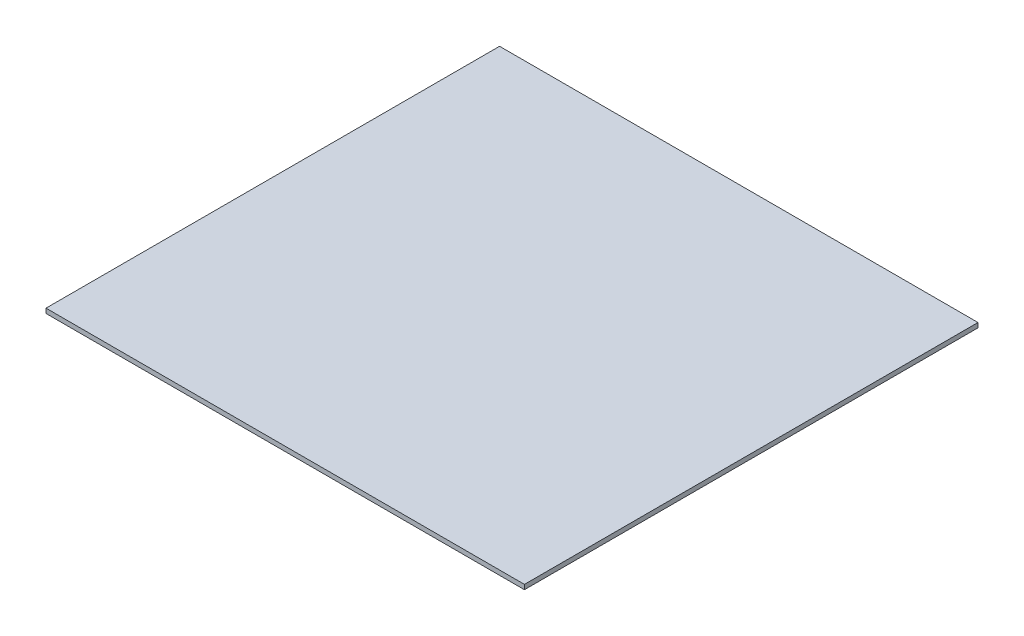
ISO-10303-21;
HEADER;
FILE_DESCRIPTION(('STEP AP214'),'2;1');
FILE_NAME('part.step','',(''),(''),'','','');
FILE_SCHEMA(('AUTOMOTIVE_DESIGN { 1 0 10303 214 1 1 1 1 }'));
ENDSEC;
DATA;
#1=APPLICATION_CONTEXT('core data for automotive mechanical design processes');
#2=APPLICATION_PROTOCOL_DEFINITION('international standard','automotive_design',2000,#1);
#3=PRODUCT_CONTEXT('',#1,'mechanical');
#4=PRODUCT('Part','Part','',(#3));
#5=PRODUCT_RELATED_PRODUCT_CATEGORY('part','',(#4));
#6=PRODUCT_DEFINITION_FORMATION('','',#4);
#7=PRODUCT_DEFINITION_CONTEXT('part definition',#1,'design');
#8=PRODUCT_DEFINITION('design','',#6,#7);
#9=PRODUCT_DEFINITION_SHAPE('','',#8);
#10=(LENGTH_UNIT() NAMED_UNIT(*) SI_UNIT(.MILLI.,.METRE.));
#11=(NAMED_UNIT(*) PLANE_ANGLE_UNIT() SI_UNIT($,.RADIAN.));
#12=(NAMED_UNIT(*) SI_UNIT($,.STERADIAN.) SOLID_ANGLE_UNIT());
#13=UNCERTAINTY_MEASURE_WITH_UNIT(LENGTH_MEASURE(1.E-05),#10,'distance_accuracy_value','');
#14=(GEOMETRIC_REPRESENTATION_CONTEXT(3) GLOBAL_UNCERTAINTY_ASSIGNED_CONTEXT((#13)) GLOBAL_UNIT_ASSIGNED_CONTEXT((#10,
#11,#12)) REPRESENTATION_CONTEXT('',''));
#15=CARTESIAN_POINT('',(0.,0.,0.));
#16=DIRECTION('',(0.,0.,1.));
#17=DIRECTION('',(1.,0.,0.));
#18=AXIS2_PLACEMENT_3D('',#15,#16,#17);
#19=CARTESIAN_POINT('',(163.5,3.175,155.));
#20=DIRECTION('',(-1.,0.,0.));
#21=DIRECTION('',(0.,0.,1.));
#22=AXIS2_PLACEMENT_3D('',#19,#20,#21);
#23=PLANE('',#22);
#24=DIRECTION('',(0.,0.,-1.));
#25=VECTOR('',#24,1.);
#26=CARTESIAN_POINT('',(163.5,0.,155.));
#27=LINE('',#26,#25);
#28=CARTESIAN_POINT('',(163.5,0.,155.));
#29=VERTEX_POINT('',#28);
#30=CARTESIAN_POINT('',(163.5,0.,-155.));
#31=VERTEX_POINT('',#30);
#32=EDGE_CURVE('E96',#29,#31,#27,.T.);
#33=ORIENTED_EDGE('',*,*,#32,.T.);
#34=DIRECTION('',(0.,-1.,0.));
#35=VECTOR('',#34,1.);
#36=CARTESIAN_POINT('',(163.5,3.175,-155.));
#37=LINE('',#36,#35);
#38=CARTESIAN_POINT('',(163.5,3.175,-155.));
#39=VERTEX_POINT('',#38);
#40=EDGE_CURVE('E11',#39,#31,#37,.T.);
#41=ORIENTED_EDGE('',*,*,#40,.F.);
#42=DIRECTION('',(0.,0.,-1.));
#43=VECTOR('',#42,1.);
#44=CARTESIAN_POINT('',(163.5,3.175,155.));
#45=LINE('',#44,#43);
#46=CARTESIAN_POINT('',(163.5,3.175,155.));
#47=VERTEX_POINT('',#46);
#48=EDGE_CURVE('E84',#47,#39,#45,.T.);
#49=ORIENTED_EDGE('',*,*,#48,.F.);
#50=DIRECTION('',(0.,-1.,0.));
#51=VECTOR('',#50,1.);
#52=CARTESIAN_POINT('',(163.5,3.175,155.));
#53=LINE('',#52,#51);
#54=EDGE_CURVE('E92',#47,#29,#53,.T.);
#55=ORIENTED_EDGE('',*,*,#54,.T.);
#56=EDGE_LOOP('',(#33,#41,#49,#55));
#57=FACE_BOUND('',#56,.T.);
#58=ADVANCED_FACE('F33',(#57),#23,.F.);
#59=CARTESIAN_POINT('',(-163.5,3.175,-155.));
#60=DIRECTION('',(0.,0.,1.));
#61=DIRECTION('',(1.,0.,0.));
#62=AXIS2_PLACEMENT_3D('',#59,#60,#61);
#63=PLANE('',#62);
#64=DIRECTION('',(-1.,0.,0.));
#65=VECTOR('',#64,1.);
#66=CARTESIAN_POINT('',(-163.5,0.,-155.));
#67=LINE('',#66,#65);
#68=CARTESIAN_POINT('',(-163.5,0.,-155.));
#69=VERTEX_POINT('',#68);
#70=EDGE_CURVE('E88',#31,#69,#67,.T.);
#71=ORIENTED_EDGE('',*,*,#70,.T.);
#72=DIRECTION('',(0.,-1.,0.));
#73=VECTOR('',#72,1.);
#74=CARTESIAN_POINT('',(-163.5,3.175,-155.));
#75=LINE('',#74,#73);
#76=CARTESIAN_POINT('',(-163.5,3.175,-155.));
#77=VERTEX_POINT('',#76);
#78=EDGE_CURVE('E41',#77,#69,#75,.T.);
#79=ORIENTED_EDGE('',*,*,#78,.F.);
#80=DIRECTION('',(-1.,0.,0.));
#81=VECTOR('',#80,1.);
#82=CARTESIAN_POINT('',(-163.5,3.175,-155.));
#83=LINE('',#82,#81);
#84=EDGE_CURVE('E79',#39,#77,#83,.T.);
#85=ORIENTED_EDGE('',*,*,#84,.F.);
#86=ORIENTED_EDGE('',*,*,#40,.T.);
#87=EDGE_LOOP('',(#71,#79,#85,#86));
#88=FACE_BOUND('',#87,.T.);
#89=ADVANCED_FACE('F87',(#88),#63,.F.);
#90=CARTESIAN_POINT('',(-163.5,3.175,155.));
#91=DIRECTION('',(1.,0.,0.));
#92=DIRECTION('',(0.,0.,-1.));
#93=AXIS2_PLACEMENT_3D('',#90,#91,#92);
#94=PLANE('',#93);
#95=DIRECTION('',(0.,0.,1.));
#96=VECTOR('',#95,1.);
#97=CARTESIAN_POINT('',(-163.5,0.,155.));
#98=LINE('',#97,#96);
#99=CARTESIAN_POINT('',(-163.5,0.,155.));
#100=VERTEX_POINT('',#99);
#101=EDGE_CURVE('E66',#69,#100,#98,.T.);
#102=ORIENTED_EDGE('',*,*,#101,.T.);
#103=DIRECTION('',(0.,-1.,0.));
#104=VECTOR('',#103,1.);
#105=CARTESIAN_POINT('',(-163.5,3.175,155.));
#106=LINE('',#105,#104);
#107=CARTESIAN_POINT('',(-163.5,3.175,155.));
#108=VERTEX_POINT('',#107);
#109=EDGE_CURVE('E89',#108,#100,#106,.T.);
#110=ORIENTED_EDGE('',*,*,#109,.F.);
#111=DIRECTION('',(0.,0.,1.));
#112=VECTOR('',#111,1.);
#113=CARTESIAN_POINT('',(-163.5,3.175,155.));
#114=LINE('',#113,#112);
#115=EDGE_CURVE('E82',#77,#108,#114,.T.);
#116=ORIENTED_EDGE('',*,*,#115,.F.);
#117=ORIENTED_EDGE('',*,*,#78,.T.);
#118=EDGE_LOOP('',(#102,#110,#116,#117));
#119=FACE_BOUND('',#118,.T.);
#120=ADVANCED_FACE('F90',(#119),#94,.F.);
#121=CARTESIAN_POINT('',(-163.5,3.175,155.));
#122=DIRECTION('',(0.,0.,-1.));
#123=DIRECTION('',(-1.,0.,0.));
#124=AXIS2_PLACEMENT_3D('',#121,#122,#123);
#125=PLANE('',#124);
#126=DIRECTION('',(1.,0.,0.));
#127=VECTOR('',#126,1.);
#128=CARTESIAN_POINT('',(-163.5,0.,155.));
#129=LINE('',#128,#127);
#130=EDGE_CURVE('E72',#100,#29,#129,.T.);
#131=ORIENTED_EDGE('',*,*,#130,.T.);
#132=ORIENTED_EDGE('',*,*,#54,.F.);
#133=DIRECTION('',(1.,0.,0.));
#134=VECTOR('',#133,1.);
#135=CARTESIAN_POINT('',(-163.5,3.175,155.));
#136=LINE('',#135,#134);
#137=EDGE_CURVE('E49',#108,#47,#136,.T.);
#138=ORIENTED_EDGE('',*,*,#137,.F.);
#139=ORIENTED_EDGE('',*,*,#109,.T.);
#140=EDGE_LOOP('',(#131,#132,#138,#139));
#141=FACE_BOUND('',#140,.T.);
#142=ADVANCED_FACE('F103',(#141),#125,.F.);
#143=CARTESIAN_POINT('',(0.,3.175,0.));
#144=DIRECTION('',(0.,-1.,0.));
#145=DIRECTION('',(0.,0.,-1.));
#146=AXIS2_PLACEMENT_3D('',#143,#144,#145);
#147=PLANE('',#146);
#148=ORIENTED_EDGE('',*,*,#48,.T.);
#149=ORIENTED_EDGE('',*,*,#84,.T.);
#150=ORIENTED_EDGE('',*,*,#115,.T.);
#151=ORIENTED_EDGE('',*,*,#137,.T.);
#152=EDGE_LOOP('',(#148,#149,#150,#151));
#153=FACE_BOUND('',#152,.T.);
#154=ADVANCED_FACE('F80',(#153),#147,.F.);
#155=CARTESIAN_POINT('',(0.,0.,0.));
#156=DIRECTION('',(0.,-1.,0.));
#157=DIRECTION('',(0.,0.,-1.));
#158=AXIS2_PLACEMENT_3D('',#155,#156,#157);
#159=PLANE('',#158);
#160=ORIENTED_EDGE('',*,*,#32,.F.);
#161=ORIENTED_EDGE('',*,*,#130,.F.);
#162=ORIENTED_EDGE('',*,*,#101,.F.);
#163=ORIENTED_EDGE('',*,*,#70,.F.);
#164=EDGE_LOOP('',(#160,#161,#162,#163));
#165=FACE_BOUND('',#164,.T.);
#166=ADVANCED_FACE('F106',(#165),#159,.T.);
#167=CLOSED_SHELL('',(#58,#89,#120,#142,#154,#166));
#168=MANIFOLD_SOLID_BREP('B2',#167);
#169=ADVANCED_BREP_SHAPE_REPRESENTATION('',(#18,#168),#14);
#170=SHAPE_DEFINITION_REPRESENTATION(#9,#169);
ENDSEC;
END-ISO-10303-21;
